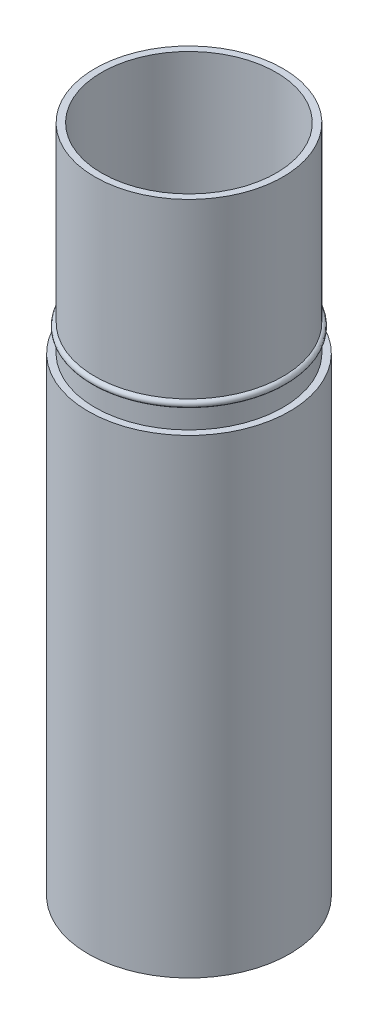
ISO-10303-21;
HEADER;
FILE_DESCRIPTION(('STEP AP214'),'2;1');
FILE_NAME('part.step','',(''),(''),'','','');
FILE_SCHEMA(('AUTOMOTIVE_DESIGN { 1 0 10303 214 1 1 1 1 }'));
ENDSEC;
DATA;
#1=APPLICATION_CONTEXT('core data for automotive mechanical design processes');
#2=APPLICATION_PROTOCOL_DEFINITION('international standard','automotive_design',2000,#1);
#3=PRODUCT_CONTEXT('',#1,'mechanical');
#4=PRODUCT('Part','Part','',(#3));
#5=PRODUCT_RELATED_PRODUCT_CATEGORY('part','',(#4));
#6=PRODUCT_DEFINITION_FORMATION('','',#4);
#7=PRODUCT_DEFINITION_CONTEXT('part definition',#1,'design');
#8=PRODUCT_DEFINITION('design','',#6,#7);
#9=PRODUCT_DEFINITION_SHAPE('','',#8);
#10=(LENGTH_UNIT() NAMED_UNIT(*) SI_UNIT(.MILLI.,.METRE.));
#11=(NAMED_UNIT(*) PLANE_ANGLE_UNIT() SI_UNIT($,.RADIAN.));
#12=(NAMED_UNIT(*) SI_UNIT($,.STERADIAN.) SOLID_ANGLE_UNIT());
#13=UNCERTAINTY_MEASURE_WITH_UNIT(LENGTH_MEASURE(1.E-05),#10,'distance_accuracy_value','');
#14=(GEOMETRIC_REPRESENTATION_CONTEXT(3) GLOBAL_UNCERTAINTY_ASSIGNED_CONTEXT((#13)) GLOBAL_UNIT_ASSIGNED_CONTEXT((#10,
#11,#12)) REPRESENTATION_CONTEXT('',''));
#15=CARTESIAN_POINT('',(0.,0.,0.));
#16=DIRECTION('',(0.,0.,1.));
#17=DIRECTION('',(1.,0.,0.));
#18=AXIS2_PLACEMENT_3D('',#15,#16,#17);
#19=CARTESIAN_POINT('',(0.,0.,0.));
#20=DIRECTION('',(0.,1.,0.));
#21=DIRECTION('',(0.,0.,1.));
#22=AXIS2_PLACEMENT_3D('',#19,#20,#21);
#23=CYLINDRICAL_SURFACE('',#22,1.31);
#24=CARTESIAN_POINT('',(0.,5.24,0.));
#25=DIRECTION('',(0.,1.,0.));
#26=DIRECTION('',(0.,0.,1.));
#27=AXIS2_PLACEMENT_3D('',#24,#25,#26);
#28=CIRCLE('',#27,1.31);
#29=CARTESIAN_POINT('',(0.,5.24,1.31));
#30=VERTEX_POINT('',#29);
#31=EDGE_CURVE('E196',#30,#30,#28,.T.);
#32=ORIENTED_EDGE('',*,*,#31,.T.);
#33=EDGE_LOOP('',(#32));
#34=FACE_BOUND('',#33,.T.);
#35=CARTESIAN_POINT('',(0.,3.275,0.));
#36=DIRECTION('',(0.,-1.,0.));
#37=DIRECTION('',(0.,0.,-1.));
#38=AXIS2_PLACEMENT_3D('',#35,#36,#37);
#39=CIRCLE('',#38,1.31);
#40=CARTESIAN_POINT('',(0.,3.275,-1.31));
#41=VERTEX_POINT('',#40);
#42=EDGE_CURVE('E41',#41,#41,#39,.F.);
#43=ORIENTED_EDGE('',*,*,#42,.F.);
#44=EDGE_LOOP('',(#43));
#45=FACE_BOUND('',#44,.T.);
#46=ADVANCED_FACE('F37',(#34,#45),#23,.F.);
#47=CARTESIAN_POINT('',(0.,5.24,0.));
#48=DIRECTION('',(0.,1.,0.));
#49=DIRECTION('',(0.,0.,1.));
#50=AXIS2_PLACEMENT_3D('',#47,#48,#49);
#51=CYLINDRICAL_SURFACE('',#50,8.515);
#52=DIRECTION('',(0.,1.,0.));
#53=VECTOR('',#52,1.);
#54=CARTESIAN_POINT('',(7.53250000000004,5.24,3.97072647635158));
#55=LINE('',#54,#53);
#56=CARTESIAN_POINT('',(7.53250000000004,54.365,3.97072647635158));
#57=VERTEX_POINT('',#56);
#58=CARTESIAN_POINT('',(7.53250000000004,5.24,3.97072647635158));
#59=VERTEX_POINT('',#58);
#60=EDGE_CURVE('E149',#57,#59,#55,.F.);
#61=ORIENTED_EDGE('',*,*,#60,.F.);
#62=CARTESIAN_POINT('',(0.,54.365,0.));
#63=DIRECTION('',(0.,-1.,0.));
#64=DIRECTION('',(0.,0.,-1.));
#65=AXIS2_PLACEMENT_3D('',#62,#63,#64);
#66=CIRCLE('',#65,8.515);
#67=CARTESIAN_POINT('',(7.20500000000004,54.365,4.53797311583039));
#68=VERTEX_POINT('',#67);
#69=EDGE_CURVE('E11',#68,#57,#66,.F.);
#70=ORIENTED_EDGE('',*,*,#69,.F.);
#71=DIRECTION('',(0.,1.,0.));
#72=VECTOR('',#71,1.);
#73=CARTESIAN_POINT('',(7.20500000000004,5.24,4.53797311583039));
#74=LINE('',#73,#72);
#75=CARTESIAN_POINT('',(7.20500000000004,5.24,4.53797311583039));
#76=VERTEX_POINT('',#75);
#77=EDGE_CURVE('E147',#76,#68,#74,.T.);
#78=ORIENTED_EDGE('',*,*,#77,.F.);
#79=CARTESIAN_POINT('',(0.,5.24,0.));
#80=DIRECTION('',(0.,1.,0.));
#81=DIRECTION('',(0.,0.,1.));
#82=AXIS2_PLACEMENT_3D('',#79,#80,#81);
#83=CIRCLE('',#82,8.515);
#84=CARTESIAN_POINT('',(-7.20499999999998,5.24,4.53797311583049));
#85=VERTEX_POINT('',#84);
#86=EDGE_CURVE('E204',#85,#76,#83,.T.);
#87=ORIENTED_EDGE('',*,*,#86,.F.);
#88=DIRECTION('',(0.,1.,0.));
#89=VECTOR('',#88,1.);
#90=CARTESIAN_POINT('',(-7.20499999999998,5.24,4.53797311583049));
#91=LINE('',#90,#89);
#92=CARTESIAN_POINT('',(-7.20499999999998,54.365,4.53797311583049));
#93=VERTEX_POINT('',#92);
#94=EDGE_CURVE('E172',#93,#85,#91,.F.);
#95=ORIENTED_EDGE('',*,*,#94,.F.);
#96=CARTESIAN_POINT('',(0.,54.365,0.));
#97=DIRECTION('',(0.,-1.,0.));
#98=DIRECTION('',(0.,0.,-1.));
#99=AXIS2_PLACEMENT_3D('',#96,#97,#98);
#100=CIRCLE('',#99,8.515);
#101=CARTESIAN_POINT('',(-7.53249999999998,54.365,3.97072647635169));
#102=VERTEX_POINT('',#101);
#103=EDGE_CURVE('E227',#102,#93,#100,.F.);
#104=ORIENTED_EDGE('',*,*,#103,.F.);
#105=DIRECTION('',(0.,1.,0.));
#106=VECTOR('',#105,1.);
#107=CARTESIAN_POINT('',(-7.53249999999998,5.24,3.97072647635169));
#108=LINE('',#107,#106);
#109=CARTESIAN_POINT('',(-7.53249999999998,5.24,3.97072647635169));
#110=VERTEX_POINT('',#109);
#111=EDGE_CURVE('E170',#110,#102,#108,.T.);
#112=ORIENTED_EDGE('',*,*,#111,.F.);
#113=CARTESIAN_POINT('',(-0.3275,5.24,-8.50869959218211));
#114=VERTEX_POINT('',#113);
#115=EDGE_CURVE('E200',#114,#110,#83,.T.);
#116=ORIENTED_EDGE('',*,*,#115,.F.);
#117=DIRECTION('',(0.,1.,0.));
#118=VECTOR('',#117,1.);
#119=CARTESIAN_POINT('',(-0.3275,5.24,-8.50869959218211));
#120=LINE('',#119,#118);
#121=CARTESIAN_POINT('',(-0.3275,54.365,-8.50869959218211));
#122=VERTEX_POINT('',#121);
#123=EDGE_CURVE('E194',#122,#114,#120,.F.);
#124=ORIENTED_EDGE('',*,*,#123,.F.);
#125=CARTESIAN_POINT('',(0.,54.365,0.));
#126=DIRECTION('',(0.,-1.,0.));
#127=DIRECTION('',(0.,0.,-1.));
#128=AXIS2_PLACEMENT_3D('',#125,#126,#127);
#129=CIRCLE('',#128,8.515);
#130=CARTESIAN_POINT('',(0.3275,54.365,-8.50869959218211));
#131=VERTEX_POINT('',#130);
#132=EDGE_CURVE('E222',#131,#122,#129,.F.);
#133=ORIENTED_EDGE('',*,*,#132,.F.);
#134=DIRECTION('',(0.,1.,0.));
#135=VECTOR('',#134,1.);
#136=CARTESIAN_POINT('',(0.3275,5.24,-8.50869959218211));
#137=LINE('',#136,#135);
#138=CARTESIAN_POINT('',(0.3275,5.24,-8.50869959218211));
#139=VERTEX_POINT('',#138);
#140=EDGE_CURVE('E192',#139,#131,#137,.T.);
#141=ORIENTED_EDGE('',*,*,#140,.F.);
#142=EDGE_CURVE('E199',#59,#139,#83,.T.);
#143=ORIENTED_EDGE('',*,*,#142,.F.);
#144=EDGE_LOOP('',(#61,#70,#78,#87,#95,#104,#112,#116,#124,#133,#141,#143));
#145=FACE_BOUND('',#144,.T.);
#146=CARTESIAN_POINT('',(0.,65.33,0.));
#147=DIRECTION('',(0.,1.,0.));
#148=DIRECTION('',(0.,0.,1.));
#149=AXIS2_PLACEMENT_3D('',#146,#147,#148);
#150=CIRCLE('',#149,8.515);
#151=CARTESIAN_POINT('',(0.,65.33,8.515));
#152=VERTEX_POINT('',#151);
#153=EDGE_CURVE('E264',#152,#152,#150,.T.);
#154=ORIENTED_EDGE('',*,*,#153,.T.);
#155=EDGE_LOOP('',(#154));
#156=FACE_BOUND('',#155,.T.);
#157=ADVANCED_FACE('F237',(#145,#156),#51,.F.);
#158=CARTESIAN_POINT('',(0.,5.24,0.));
#159=DIRECTION('',(0.,1.,0.));
#160=DIRECTION('',(0.,0.,1.));
#161=AXIS2_PLACEMENT_3D('',#158,#159,#160);
#162=PLANE('',#161);
#163=ORIENTED_EDGE('',*,*,#31,.F.);
#164=EDGE_LOOP('',(#163));
#165=FACE_BOUND('',#164,.T.);
#166=DIRECTION('',(-0.499999999999992,0.,0.866025403784443));
#167=VECTOR('',#166,1.);
#168=CARTESIAN_POINT('',(7.25433299348513,5.24,3.81012668026053));
#169=LINE('',#168,#167);
#170=CARTESIAN_POINT('',(7.25433299348513,5.24,3.81012668026053));
#171=VERTEX_POINT('',#170);
#172=CARTESIAN_POINT('',(6.92683299348513,5.24,4.37737331973934));
#173=VERTEX_POINT('',#172);
#174=EDGE_CURVE('E234',#171,#173,#169,.T.);
#175=ORIENTED_EDGE('',*,*,#174,.F.);
#176=DIRECTION('',(0.866025403784443,0.,0.499999999999992));
#177=VECTOR('',#176,1.);
#178=CARTESIAN_POINT('',(0.163749999999998,5.24,-0.283623319739405));
#179=LINE('',#178,#177);
#180=EDGE_CURVE('E46',#171,#59,#179,.T.);
#181=ORIENTED_EDGE('',*,*,#180,.T.);
#182=ORIENTED_EDGE('',*,*,#142,.T.);
#183=DIRECTION('',(0.,0.,-1.));
#184=VECTOR('',#183,1.);
#185=CARTESIAN_POINT('',(0.3275,5.24,-8.1875));
#186=LINE('',#185,#184);
#187=CARTESIAN_POINT('',(0.3275,5.24,-8.1875));
#188=VERTEX_POINT('',#187);
#189=EDGE_CURVE('E178',#188,#139,#186,.T.);
#190=ORIENTED_EDGE('',*,*,#189,.F.);
#191=DIRECTION('',(1.,0.,0.));
#192=VECTOR('',#191,1.);
#193=CARTESIAN_POINT('',(-0.3275,5.24,-8.1875));
#194=LINE('',#193,#192);
#195=CARTESIAN_POINT('',(-0.3275,5.24,-8.1875));
#196=VERTEX_POINT('',#195);
#197=EDGE_CURVE('E174',#196,#188,#194,.T.);
#198=ORIENTED_EDGE('',*,*,#197,.F.);
#199=DIRECTION('',(0.,0.,-1.));
#200=VECTOR('',#199,1.);
#201=CARTESIAN_POINT('',(-0.3275,5.24,0.));
#202=LINE('',#201,#200);
#203=EDGE_CURVE('E219',#196,#114,#202,.T.);
#204=ORIENTED_EDGE('',*,*,#203,.T.);
#205=ORIENTED_EDGE('',*,*,#115,.T.);
#206=DIRECTION('',(-0.866025403784436,0.,0.500000000000004));
#207=VECTOR('',#206,1.);
#208=CARTESIAN_POINT('',(-7.25433299348508,5.24,3.81012668026063));
#209=LINE('',#208,#207);
#210=CARTESIAN_POINT('',(-7.25433299348508,5.24,3.81012668026063));
#211=VERTEX_POINT('',#210);
#212=EDGE_CURVE('E159',#211,#110,#209,.T.);
#213=ORIENTED_EDGE('',*,*,#212,.F.);
#214=DIRECTION('',(-0.500000000000004,0.,-0.866025403784436));
#215=VECTOR('',#214,1.);
#216=CARTESIAN_POINT('',(-6.92683299348507,5.24,4.37737331973944));
#217=LINE('',#216,#215);
#218=CARTESIAN_POINT('',(-6.92683299348507,5.24,4.37737331973944));
#219=VERTEX_POINT('',#218);
#220=EDGE_CURVE('E155',#219,#211,#217,.T.);
#221=ORIENTED_EDGE('',*,*,#220,.F.);
#222=DIRECTION('',(-0.866025403784436,0.,0.500000000000004));
#223=VECTOR('',#222,1.);
#224=CARTESIAN_POINT('',(0.163750000000001,5.24,0.283623319739403));
#225=LINE('',#224,#223);
#226=EDGE_CURVE('E224',#219,#85,#225,.T.);
#227=ORIENTED_EDGE('',*,*,#226,.T.);
#228=ORIENTED_EDGE('',*,*,#86,.T.);
#229=DIRECTION('',(0.866025403784443,0.,0.499999999999992));
#230=VECTOR('',#229,1.);
#231=CARTESIAN_POINT('',(6.92683299348513,5.24,4.37737331973934));
#232=LINE('',#231,#230);
#233=EDGE_CURVE('E136',#173,#76,#232,.T.);
#234=ORIENTED_EDGE('',*,*,#233,.F.);
#235=EDGE_LOOP('',(#175,#181,#182,#190,#198,#204,#205,#213,#221,#227,#228,#234));
#236=FACE_BOUND('',#235,.T.);
#237=ADVANCED_FACE('F231',(#165,#236),#162,.T.);
#238=CARTESIAN_POINT('',(0.,56.33,0.));
#239=DIRECTION('',(0.,-1.,0.));
#240=DIRECTION('',(0.,0.,-1.));
#241=AXIS2_PLACEMENT_3D('',#238,#239,#240);
#242=CYLINDRICAL_SURFACE('',#241,9.17);
#243=CARTESIAN_POINT('',(0.,45.85,0.));
#244=DIRECTION('',(0.,1.,0.));
#245=DIRECTION('',(0.,0.,1.));
#246=AXIS2_PLACEMENT_3D('',#243,#244,#245);
#247=CIRCLE('',#246,9.17);
#248=CARTESIAN_POINT('',(0.,45.85,9.17));
#249=VERTEX_POINT('',#248);
#250=EDGE_CURVE('E203',#249,#249,#247,.T.);
#251=ORIENTED_EDGE('',*,*,#250,.T.);
#252=EDGE_LOOP('',(#251));
#253=FACE_BOUND('',#252,.T.);
#254=CARTESIAN_POINT('',(0.,47.815,0.));
#255=DIRECTION('',(0.,1.,0.));
#256=DIRECTION('',(0.,0.,1.));
#257=AXIS2_PLACEMENT_3D('',#254,#255,#256);
#258=CIRCLE('',#257,9.17);
#259=CARTESIAN_POINT('',(0.,47.815,9.17));
#260=VERTEX_POINT('',#259);
#261=EDGE_CURVE('E216',#260,#260,#258,.T.);
#262=ORIENTED_EDGE('',*,*,#261,.F.);
#263=EDGE_LOOP('',(#262));
#264=FACE_BOUND('',#263,.T.);
#265=ADVANCED_FACE('F293',(#253,#264),#242,.T.);
#266=CARTESIAN_POINT('',(0.,45.85,0.));
#267=DIRECTION('',(0.,-1.,0.));
#268=DIRECTION('',(0.,0.,-1.));
#269=AXIS2_PLACEMENT_3D('',#266,#267,#268);
#270=CYLINDRICAL_SURFACE('',#269,9.825);
#271=CARTESIAN_POINT('',(0.,45.85,0.));
#272=DIRECTION('',(0.,1.,0.));
#273=DIRECTION('',(0.,0.,1.));
#274=AXIS2_PLACEMENT_3D('',#271,#272,#273);
#275=CIRCLE('',#274,9.825);
#276=CARTESIAN_POINT('',(0.,45.85,9.825));
#277=VERTEX_POINT('',#276);
#278=EDGE_CURVE('E208',#277,#277,#275,.T.);
#279=ORIENTED_EDGE('',*,*,#278,.F.);
#280=EDGE_LOOP('',(#279));
#281=FACE_BOUND('',#280,.T.);
#282=CARTESIAN_POINT('',(0.,0.,0.));
#283=DIRECTION('',(0.,1.,0.));
#284=DIRECTION('',(0.,0.,1.));
#285=AXIS2_PLACEMENT_3D('',#282,#283,#284);
#286=CIRCLE('',#285,9.825);
#287=CARTESIAN_POINT('',(0.,0.,9.825));
#288=VERTEX_POINT('',#287);
#289=EDGE_CURVE('E207',#288,#288,#286,.T.);
#290=ORIENTED_EDGE('',*,*,#289,.T.);
#291=EDGE_LOOP('',(#290));
#292=FACE_BOUND('',#291,.T.);
#293=ADVANCED_FACE('F39',(#281,#292),#270,.T.);
#294=CARTESIAN_POINT('',(0.,45.85,0.));
#295=DIRECTION('',(0.,1.,0.));
#296=DIRECTION('',(0.,0.,1.));
#297=AXIS2_PLACEMENT_3D('',#294,#295,#296);
#298=PLANE('',#297);
#299=ORIENTED_EDGE('',*,*,#250,.F.);
#300=EDGE_LOOP('',(#299));
#301=FACE_BOUND('',#300,.T.);
#302=ORIENTED_EDGE('',*,*,#278,.T.);
#303=EDGE_LOOP('',(#302));
#304=FACE_BOUND('',#303,.T.);
#305=ADVANCED_FACE('F305',(#301,#304),#298,.T.);
#306=CARTESIAN_POINT('',(0.,0.,0.));
#307=DIRECTION('',(0.,1.,0.));
#308=DIRECTION('',(0.,0.,1.));
#309=AXIS2_PLACEMENT_3D('',#306,#307,#308);
#310=PLANE('',#309);
#311=CARTESIAN_POINT('',(0.,0.,0.));
#312=DIRECTION('',(0.,-1.,0.));
#313=DIRECTION('',(0.,0.,-1.));
#314=AXIS2_PLACEMENT_3D('',#311,#312,#313);
#315=CIRCLE('',#314,9.17);
#316=CARTESIAN_POINT('',(0.,0.,-9.17));
#317=VERTEX_POINT('',#316);
#318=EDGE_CURVE('E254',#317,#317,#315,.T.);
#319=ORIENTED_EDGE('',*,*,#318,.F.);
#320=EDGE_LOOP('',(#319));
#321=FACE_BOUND('',#320,.T.);
#322=ORIENTED_EDGE('',*,*,#289,.F.);
#323=EDGE_LOOP('',(#322));
#324=FACE_BOUND('',#323,.T.);
#325=ADVANCED_FACE('F300',(#321,#324),#310,.F.);
#326=CARTESIAN_POINT('',(0.,48.1425,0.));
#327=DIRECTION('',(0.,-1.,0.));
#328=DIRECTION('',(0.,0.,-1.));
#329=AXIS2_PLACEMENT_3D('',#326,#327,#328);
#330=TOROIDAL_SURFACE('',#329,9.17,0.327500000000001);
#331=ORIENTED_EDGE('',*,*,#261,.T.);
#332=EDGE_LOOP('',(#331));
#333=FACE_BOUND('',#332,.T.);
#334=CARTESIAN_POINT('',(0.,48.47,0.));
#335=DIRECTION('',(0.,-1.,0.));
#336=DIRECTION('',(0.,0.,-1.));
#337=AXIS2_PLACEMENT_3D('',#334,#335,#336);
#338=CIRCLE('',#337,9.17);
#339=CARTESIAN_POINT('',(0.,48.47,-9.17));
#340=VERTEX_POINT('',#339);
#341=EDGE_CURVE('E211',#340,#340,#338,.T.);
#342=ORIENTED_EDGE('',*,*,#341,.T.);
#343=EDGE_LOOP('',(#342));
#344=FACE_BOUND('',#343,.T.);
#345=ADVANCED_FACE('F296',(#333,#344),#330,.T.);
#346=ORIENTED_EDGE('',*,*,#341,.F.);
#347=EDGE_LOOP('',(#346));
#348=FACE_BOUND('',#347,.T.);
#349=CARTESIAN_POINT('',(0.,65.33,0.));
#350=DIRECTION('',(0.,1.,0.));
#351=DIRECTION('',(0.,0.,1.));
#352=AXIS2_PLACEMENT_3D('',#349,#350,#351);
#353=CIRCLE('',#352,9.17);
#354=CARTESIAN_POINT('',(0.,65.33,9.17));
#355=VERTEX_POINT('',#354);
#356=EDGE_CURVE('E259',#355,#355,#353,.T.);
#357=ORIENTED_EDGE('',*,*,#356,.F.);
#358=EDGE_LOOP('',(#357));
#359=FACE_BOUND('',#358,.T.);
#360=ADVANCED_FACE('F299',(#348,#359),#242,.T.);
#361=CARTESIAN_POINT('',(0.,54.365,0.));
#362=DIRECTION('',(0.,-1.,0.));
#363=DIRECTION('',(0.,0.,-1.));
#364=AXIS2_PLACEMENT_3D('',#361,#362,#363);
#365=PLANE('',#364);
#366=DIRECTION('',(0.,0.,-1.));
#367=VECTOR('',#366,1.);
#368=CARTESIAN_POINT('',(0.3275,54.365,-8.1875));
#369=LINE('',#368,#367);
#370=CARTESIAN_POINT('',(0.3275,54.365,-8.1875));
#371=VERTEX_POINT('',#370);
#372=EDGE_CURVE('E180',#371,#131,#369,.T.);
#373=ORIENTED_EDGE('',*,*,#372,.T.);
#374=ORIENTED_EDGE('',*,*,#132,.T.);
#375=DIRECTION('',(0.,0.,1.));
#376=VECTOR('',#375,1.);
#377=CARTESIAN_POINT('',(-0.3275,54.365,-8.1875));
#378=LINE('',#377,#376);
#379=CARTESIAN_POINT('',(-0.3275,54.365,-8.1875));
#380=VERTEX_POINT('',#379);
#381=EDGE_CURVE('E175',#122,#380,#378,.T.);
#382=ORIENTED_EDGE('',*,*,#381,.T.);
#383=DIRECTION('',(1.,0.,0.));
#384=VECTOR('',#383,1.);
#385=CARTESIAN_POINT('',(-0.3275,54.365,-8.1875));
#386=LINE('',#385,#384);
#387=EDGE_CURVE('E177',#380,#371,#386,.T.);
#388=ORIENTED_EDGE('',*,*,#387,.T.);
#389=EDGE_LOOP('',(#373,#374,#382,#388));
#390=FACE_BOUND('',#389,.T.);
#391=ADVANCED_FACE('F348',(#390),#365,.F.);
#392=CARTESIAN_POINT('',(-0.3275,54.365,-8.1875));
#393=DIRECTION('',(1.,0.,0.));
#394=DIRECTION('',(0.,0.,-1.));
#395=AXIS2_PLACEMENT_3D('',#392,#393,#394);
#396=PLANE('',#395);
#397=ORIENTED_EDGE('',*,*,#381,.F.);
#398=ORIENTED_EDGE('',*,*,#123,.T.);
#399=ORIENTED_EDGE('',*,*,#203,.F.);
#400=DIRECTION('',(0.,-1.,0.));
#401=VECTOR('',#400,1.);
#402=CARTESIAN_POINT('',(-0.3275,54.365,-8.1875));
#403=LINE('',#402,#401);
#404=EDGE_CURVE('E189',#380,#196,#403,.T.);
#405=ORIENTED_EDGE('',*,*,#404,.F.);
#406=EDGE_LOOP('',(#397,#398,#399,#405));
#407=FACE_BOUND('',#406,.T.);
#408=ADVANCED_FACE('F290',(#407),#396,.F.);
#409=CARTESIAN_POINT('',(0.3275,54.365,-8.1875));
#410=DIRECTION('',(-1.,0.,0.));
#411=DIRECTION('',(0.,0.,1.));
#412=AXIS2_PLACEMENT_3D('',#409,#410,#411);
#413=PLANE('',#412);
#414=ORIENTED_EDGE('',*,*,#189,.T.);
#415=ORIENTED_EDGE('',*,*,#140,.T.);
#416=ORIENTED_EDGE('',*,*,#372,.F.);
#417=DIRECTION('',(0.,-1.,0.));
#418=VECTOR('',#417,1.);
#419=CARTESIAN_POINT('',(0.3275,54.365,-8.1875));
#420=LINE('',#419,#418);
#421=EDGE_CURVE('E183',#371,#188,#420,.T.);
#422=ORIENTED_EDGE('',*,*,#421,.T.);
#423=EDGE_LOOP('',(#414,#415,#416,#422));
#424=FACE_BOUND('',#423,.T.);
#425=ADVANCED_FACE('F361',(#424),#413,.F.);
#426=CARTESIAN_POINT('',(-0.3275,54.365,-8.1875));
#427=DIRECTION('',(0.,0.,-1.));
#428=DIRECTION('',(-1.,0.,0.));
#429=AXIS2_PLACEMENT_3D('',#426,#427,#428);
#430=PLANE('',#429);
#431=ORIENTED_EDGE('',*,*,#197,.T.);
#432=ORIENTED_EDGE('',*,*,#421,.F.);
#433=ORIENTED_EDGE('',*,*,#387,.F.);
#434=ORIENTED_EDGE('',*,*,#404,.T.);
#435=EDGE_LOOP('',(#431,#432,#433,#434));
#436=FACE_BOUND('',#435,.T.);
#437=ADVANCED_FACE('F370',(#436),#430,.F.);
#438=CARTESIAN_POINT('',(0.,54.365,0.));
#439=DIRECTION('',(0.,-1.,0.));
#440=DIRECTION('',(-0.866025403784436,0.,0.500000000000004));
#441=AXIS2_PLACEMENT_3D('',#438,#439,#440);
#442=PLANE('',#441);
#443=DIRECTION('',(-0.866025403784436,0.,0.500000000000004));
#444=VECTOR('',#443,1.);
#445=CARTESIAN_POINT('',(-7.25433299348508,54.365,3.81012668026063));
#446=LINE('',#445,#444);
#447=CARTESIAN_POINT('',(-7.25433299348508,54.365,3.81012668026063));
#448=VERTEX_POINT('',#447);
#449=EDGE_CURVE('E161',#448,#102,#446,.T.);
#450=ORIENTED_EDGE('',*,*,#449,.T.);
#451=ORIENTED_EDGE('',*,*,#103,.T.);
#452=DIRECTION('',(0.866025403784436,0.,-0.500000000000004));
#453=VECTOR('',#452,1.);
#454=CARTESIAN_POINT('',(-6.92683299348507,54.365,4.37737331973944));
#455=LINE('',#454,#453);
#456=CARTESIAN_POINT('',(-6.92683299348507,54.365,4.37737331973944));
#457=VERTEX_POINT('',#456);
#458=EDGE_CURVE('E156',#93,#457,#455,.T.);
#459=ORIENTED_EDGE('',*,*,#458,.T.);
#460=DIRECTION('',(-0.500000000000004,0.,-0.866025403784436));
#461=VECTOR('',#460,1.);
#462=CARTESIAN_POINT('',(-6.92683299348507,54.365,4.37737331973944));
#463=LINE('',#462,#461);
#464=EDGE_CURVE('E158',#457,#448,#463,.T.);
#465=ORIENTED_EDGE('',*,*,#464,.T.);
#466=EDGE_LOOP('',(#450,#451,#459,#465));
#467=FACE_BOUND('',#466,.T.);
#468=ADVANCED_FACE('F380',(#467),#442,.F.);
#469=CARTESIAN_POINT('',(-6.92683299348507,54.365,4.37737331973944));
#470=DIRECTION('',(-0.500000000000004,0.,-0.866025403784436));
#471=DIRECTION('',(-0.866025403784436,0.,0.500000000000004));
#472=AXIS2_PLACEMENT_3D('',#469,#470,#471);
#473=PLANE('',#472);
#474=ORIENTED_EDGE('',*,*,#458,.F.);
#475=ORIENTED_EDGE('',*,*,#94,.T.);
#476=ORIENTED_EDGE('',*,*,#226,.F.);
#477=DIRECTION('',(0.,-1.,0.));
#478=VECTOR('',#477,1.);
#479=CARTESIAN_POINT('',(-6.92683299348507,54.365,4.37737331973944));
#480=LINE('',#479,#478);
#481=EDGE_CURVE('E167',#457,#219,#480,.T.);
#482=ORIENTED_EDGE('',*,*,#481,.F.);
#483=EDGE_LOOP('',(#474,#475,#476,#482));
#484=FACE_BOUND('',#483,.T.);
#485=ADVANCED_FACE('F390',(#484),#473,.F.);
#486=CARTESIAN_POINT('',(-7.25433299348508,54.365,3.81012668026063));
#487=DIRECTION('',(0.500000000000004,0.,0.866025403784436));
#488=DIRECTION('',(0.866025403784436,0.,-0.500000000000004));
#489=AXIS2_PLACEMENT_3D('',#486,#487,#488);
#490=PLANE('',#489);
#491=ORIENTED_EDGE('',*,*,#212,.T.);
#492=ORIENTED_EDGE('',*,*,#111,.T.);
#493=ORIENTED_EDGE('',*,*,#449,.F.);
#494=DIRECTION('',(0.,-1.,0.));
#495=VECTOR('',#494,1.);
#496=CARTESIAN_POINT('',(-7.25433299348508,54.365,3.81012668026063));
#497=LINE('',#496,#495);
#498=EDGE_CURVE('E61',#448,#211,#497,.T.);
#499=ORIENTED_EDGE('',*,*,#498,.T.);
#500=EDGE_LOOP('',(#491,#492,#493,#499));
#501=FACE_BOUND('',#500,.T.);
#502=ADVANCED_FACE('F401',(#501),#490,.F.);
#503=CARTESIAN_POINT('',(-6.92683299348507,54.365,4.37737331973944));
#504=DIRECTION('',(-0.866025403784436,0.,0.500000000000004));
#505=DIRECTION('',(0.500000000000004,0.,0.866025403784436));
#506=AXIS2_PLACEMENT_3D('',#503,#504,#505);
#507=PLANE('',#506);
#508=ORIENTED_EDGE('',*,*,#220,.T.);
#509=ORIENTED_EDGE('',*,*,#498,.F.);
#510=ORIENTED_EDGE('',*,*,#464,.F.);
#511=ORIENTED_EDGE('',*,*,#481,.T.);
#512=EDGE_LOOP('',(#508,#509,#510,#511));
#513=FACE_BOUND('',#512,.T.);
#514=ADVANCED_FACE('F411',(#513),#507,.F.);
#515=CARTESIAN_POINT('',(0.,54.365,0.));
#516=DIRECTION('',(0.,-1.,0.));
#517=DIRECTION('',(0.866025403784443,0.,0.499999999999992));
#518=AXIS2_PLACEMENT_3D('',#515,#516,#517);
#519=PLANE('',#518);
#520=DIRECTION('',(0.866025403784443,0.,0.499999999999992));
#521=VECTOR('',#520,1.);
#522=CARTESIAN_POINT('',(6.92683299348513,54.365,4.37737331973934));
#523=LINE('',#522,#521);
#524=CARTESIAN_POINT('',(6.92683299348513,54.365,4.37737331973934));
#525=VERTEX_POINT('',#524);
#526=EDGE_CURVE('E143',#525,#68,#523,.T.);
#527=ORIENTED_EDGE('',*,*,#526,.T.);
#528=ORIENTED_EDGE('',*,*,#69,.T.);
#529=DIRECTION('',(-0.866025403784443,0.,-0.499999999999992));
#530=VECTOR('',#529,1.);
#531=CARTESIAN_POINT('',(7.25433299348513,54.365,3.81012668026053));
#532=LINE('',#531,#530);
#533=CARTESIAN_POINT('',(7.25433299348513,54.365,3.81012668026053));
#534=VERTEX_POINT('',#533);
#535=EDGE_CURVE('E127',#57,#534,#532,.T.);
#536=ORIENTED_EDGE('',*,*,#535,.T.);
#537=DIRECTION('',(-0.499999999999992,0.,0.866025403784443));
#538=VECTOR('',#537,1.);
#539=CARTESIAN_POINT('',(7.25433299348513,54.365,3.81012668026053));
#540=LINE('',#539,#538);
#541=EDGE_CURVE('E131',#534,#525,#540,.T.);
#542=ORIENTED_EDGE('',*,*,#541,.T.);
#543=EDGE_LOOP('',(#527,#528,#536,#542));
#544=FACE_BOUND('',#543,.T.);
#545=ADVANCED_FACE('F130',(#544),#519,.F.);
#546=CARTESIAN_POINT('',(7.25433299348513,54.365,3.81012668026053));
#547=DIRECTION('',(-0.499999999999992,0.,0.866025403784443));
#548=DIRECTION('',(0.866025403784443,0.,0.499999999999992));
#549=AXIS2_PLACEMENT_3D('',#546,#547,#548);
#550=PLANE('',#549);
#551=ORIENTED_EDGE('',*,*,#535,.F.);
#552=ORIENTED_EDGE('',*,*,#60,.T.);
#553=ORIENTED_EDGE('',*,*,#180,.F.);
#554=DIRECTION('',(0.,-1.,0.));
#555=VECTOR('',#554,1.);
#556=CARTESIAN_POINT('',(7.25433299348513,54.365,3.81012668026053));
#557=LINE('',#556,#555);
#558=EDGE_CURVE('E141',#534,#171,#557,.T.);
#559=ORIENTED_EDGE('',*,*,#558,.F.);
#560=EDGE_LOOP('',(#551,#552,#553,#559));
#561=FACE_BOUND('',#560,.T.);
#562=ADVANCED_FACE('F145',(#561),#550,.F.);
#563=CARTESIAN_POINT('',(6.92683299348513,54.365,4.37737331973934));
#564=DIRECTION('',(0.499999999999992,0.,-0.866025403784443));
#565=DIRECTION('',(-0.866025403784443,0.,-0.499999999999992));
#566=AXIS2_PLACEMENT_3D('',#563,#564,#565);
#567=PLANE('',#566);
#568=ORIENTED_EDGE('',*,*,#233,.T.);
#569=ORIENTED_EDGE('',*,*,#77,.T.);
#570=ORIENTED_EDGE('',*,*,#526,.F.);
#571=DIRECTION('',(0.,-1.,0.));
#572=VECTOR('',#571,1.);
#573=CARTESIAN_POINT('',(6.92683299348513,54.365,4.37737331973934));
#574=LINE('',#573,#572);
#575=EDGE_CURVE('E53',#525,#173,#574,.T.);
#576=ORIENTED_EDGE('',*,*,#575,.T.);
#577=EDGE_LOOP('',(#568,#569,#570,#576));
#578=FACE_BOUND('',#577,.T.);
#579=ADVANCED_FACE('F246',(#578),#567,.F.);
#580=CARTESIAN_POINT('',(7.25433299348513,54.365,3.81012668026053));
#581=DIRECTION('',(0.866025403784443,0.,0.499999999999992));
#582=DIRECTION('',(0.499999999999992,0.,-0.866025403784443));
#583=AXIS2_PLACEMENT_3D('',#580,#581,#582);
#584=PLANE('',#583);
#585=ORIENTED_EDGE('',*,*,#174,.T.);
#586=ORIENTED_EDGE('',*,*,#575,.F.);
#587=ORIENTED_EDGE('',*,*,#541,.F.);
#588=ORIENTED_EDGE('',*,*,#558,.T.);
#589=EDGE_LOOP('',(#585,#586,#587,#588));
#590=FACE_BOUND('',#589,.T.);
#591=ADVANCED_FACE('F140',(#590),#584,.F.);
#592=CARTESIAN_POINT('',(0.,3.275,0.));
#593=DIRECTION('',(0.,-1.,0.));
#594=DIRECTION('',(0.,0.,-1.));
#595=AXIS2_PLACEMENT_3D('',#592,#593,#594);
#596=PLANE('',#595);
#597=CARTESIAN_POINT('',(0.,3.275,0.));
#598=DIRECTION('',(0.,-1.,0.));
#599=DIRECTION('',(0.,0.,-1.));
#600=AXIS2_PLACEMENT_3D('',#597,#598,#599);
#601=CIRCLE('',#600,9.17);
#602=CARTESIAN_POINT('',(0.,3.275,-9.17));
#603=VERTEX_POINT('',#602);
#604=EDGE_CURVE('E250',#603,#603,#601,.T.);
#605=ORIENTED_EDGE('',*,*,#604,.T.);
#606=EDGE_LOOP('',(#605));
#607=FACE_BOUND('',#606,.T.);
#608=ORIENTED_EDGE('',*,*,#42,.T.);
#609=EDGE_LOOP('',(#608));
#610=FACE_BOUND('',#609,.T.);
#611=ADVANCED_FACE('F276',(#607,#610),#596,.T.);
#612=CARTESIAN_POINT('',(0.,3.275,0.));
#613=DIRECTION('',(0.,-1.,0.));
#614=DIRECTION('',(0.,0.,-1.));
#615=AXIS2_PLACEMENT_3D('',#612,#613,#614);
#616=CYLINDRICAL_SURFACE('',#615,9.17);
#617=ORIENTED_EDGE('',*,*,#604,.F.);
#618=EDGE_LOOP('',(#617));
#619=FACE_BOUND('',#618,.T.);
#620=ORIENTED_EDGE('',*,*,#318,.T.);
#621=EDGE_LOOP('',(#620));
#622=FACE_BOUND('',#621,.T.);
#623=ADVANCED_FACE('F270',(#619,#622),#616,.F.);
#624=CARTESIAN_POINT('',(0.,65.33,0.));
#625=DIRECTION('',(0.,1.,0.));
#626=DIRECTION('',(0.,0.,1.));
#627=AXIS2_PLACEMENT_3D('',#624,#625,#626);
#628=PLANE('',#627);
#629=ORIENTED_EDGE('',*,*,#356,.T.);
#630=EDGE_LOOP('',(#629));
#631=FACE_BOUND('',#630,.T.);
#632=ORIENTED_EDGE('',*,*,#153,.F.);
#633=EDGE_LOOP('',(#632));
#634=FACE_BOUND('',#633,.T.);
#635=ADVANCED_FACE('F268',(#631,#634),#628,.T.);
#636=CLOSED_SHELL('',(#46,#157,#237,#265,#293,#305,#325,#345,#360,#391,#408,#425,#437,#468,#485,
#502,#514,#545,#562,#579,#591,#611,#623,#635));
#637=MANIFOLD_SOLID_BREP('B2',#636);
#638=ADVANCED_BREP_SHAPE_REPRESENTATION('',(#18,#637),#14);
#639=SHAPE_DEFINITION_REPRESENTATION(#9,#638);
ENDSEC;
END-ISO-10303-21;
